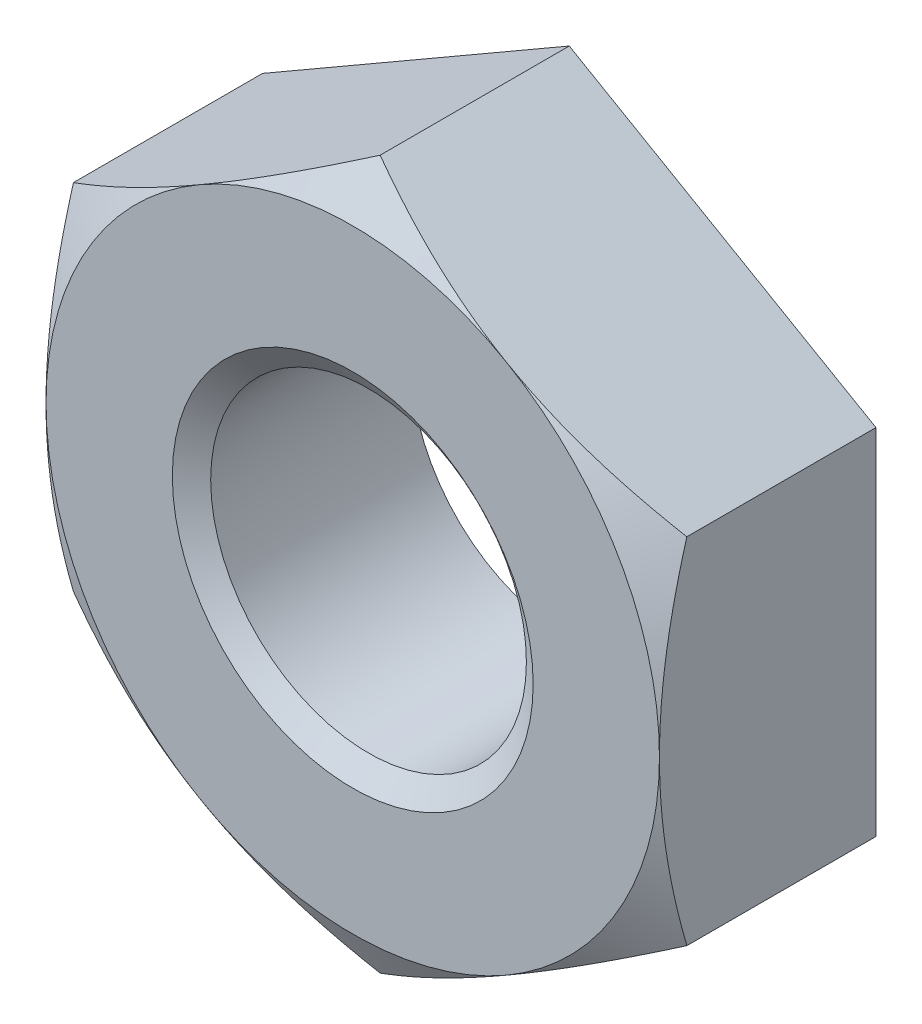
ISO-10303-21;
HEADER;
FILE_DESCRIPTION(('STEP AP214'),'2;1');
FILE_NAME('part.step','',(''),(''),'','','');
FILE_SCHEMA(('AUTOMOTIVE_DESIGN { 1 0 10303 214 1 1 1 1 }'));
ENDSEC;
DATA;
#1=APPLICATION_CONTEXT('core data for automotive mechanical design processes');
#2=APPLICATION_PROTOCOL_DEFINITION('international standard','automotive_design',2000,#1);
#3=PRODUCT_CONTEXT('',#1,'mechanical');
#4=PRODUCT('Part','Part','',(#3));
#5=PRODUCT_RELATED_PRODUCT_CATEGORY('part','',(#4));
#6=PRODUCT_DEFINITION_FORMATION('','',#4);
#7=PRODUCT_DEFINITION_CONTEXT('part definition',#1,'design');
#8=PRODUCT_DEFINITION('design','',#6,#7);
#9=PRODUCT_DEFINITION_SHAPE('','',#8);
#10=(LENGTH_UNIT() NAMED_UNIT(*) SI_UNIT(.MILLI.,.METRE.));
#11=(NAMED_UNIT(*) PLANE_ANGLE_UNIT() SI_UNIT($,.RADIAN.));
#12=(NAMED_UNIT(*) SI_UNIT($,.STERADIAN.) SOLID_ANGLE_UNIT());
#13=UNCERTAINTY_MEASURE_WITH_UNIT(LENGTH_MEASURE(1.E-05),#10,'distance_accuracy_value','');
#14=(GEOMETRIC_REPRESENTATION_CONTEXT(3) GLOBAL_UNCERTAINTY_ASSIGNED_CONTEXT((#13)) GLOBAL_UNIT_ASSIGNED_CONTEXT((#10,
#11,#12)) REPRESENTATION_CONTEXT('',''));
#15=CARTESIAN_POINT('',(0.,0.,0.));
#16=DIRECTION('',(0.,0.,1.));
#17=DIRECTION('',(1.,0.,0.));
#18=AXIS2_PLACEMENT_3D('',#15,#16,#17);
#19=CARTESIAN_POINT('',(0.,0.,-18.));
#20=DIRECTION('',(0.,0.,1.));
#21=DIRECTION('',(1.,0.,0.));
#22=AXIS2_PLACEMENT_3D('',#19,#20,#21);
#23=CYLINDRICAL_SURFACE('',#22,8.75);
#24=CARTESIAN_POINT('',(0.,0.,-0.87525942276214));
#25=DIRECTION('',(0.,0.,1.));
#26=DIRECTION('',(1.,0.,0.));
#27=AXIS2_PLACEMENT_3D('',#24,#25,#26);
#28=CIRCLE('',#27,8.75);
#29=CARTESIAN_POINT('',(8.75,0.,-0.87525942276214));
#30=VERTEX_POINT('',#29);
#31=EDGE_CURVE('E140',#30,#30,#28,.F.);
#32=ORIENTED_EDGE('',*,*,#31,.F.);
#33=EDGE_LOOP('',(#32));
#34=FACE_BOUND('',#33,.T.);
#35=CARTESIAN_POINT('',(0.,0.,-12.));
#36=DIRECTION('',(0.,0.,-1.));
#37=DIRECTION('',(-1.,0.,0.));
#38=AXIS2_PLACEMENT_3D('',#35,#36,#37);
#39=CIRCLE('',#38,8.75);
#40=CARTESIAN_POINT('',(-8.75,0.,-12.));
#41=VERTEX_POINT('',#40);
#42=EDGE_CURVE('E120',#41,#41,#39,.F.);
#43=ORIENTED_EDGE('',*,*,#42,.F.);
#44=EDGE_LOOP('',(#43));
#45=FACE_BOUND('',#44,.T.);
#46=ADVANCED_FACE('F37',(#34,#45),#23,.F.);
#47=CARTESIAN_POINT('',(0.,19.6299091524473,-18.));
#48=DIRECTION('',(-0.500000000000001,0.866025403784438,0.));
#49=DIRECTION('',(-0.866025403784438,-0.500000000000001,0.));
#50=AXIS2_PLACEMENT_3D('',#47,#48,#49);
#51=PLANE('',#50);
#52=DIRECTION('',(0.,0.,1.));
#53=VECTOR('',#52,1.);
#54=CARTESIAN_POINT('',(0.,19.6299091524473,-18.));
#55=LINE('',#54,#53);
#56=CARTESIAN_POINT('',(0.,19.6299091524473,-12.));
#57=VERTEX_POINT('',#56);
#58=CARTESIAN_POINT('',(0.,19.6299091524473,-1.51837875710971));
#59=VERTEX_POINT('',#58);
#60=EDGE_CURVE('E119',#57,#59,#55,.T.);
#61=ORIENTED_EDGE('',*,*,#60,.F.);
#62=DIRECTION('',(-0.866025403784438,-0.500000000000001,0.));
#63=VECTOR('',#62,1.);
#64=CARTESIAN_POINT('',(0.,19.6299091524473,-12.));
#65=LINE('',#64,#63);
#66=CARTESIAN_POINT('',(-17.,9.81495457622363,-12.));
#67=VERTEX_POINT('',#66);
#68=EDGE_CURVE('E108',#57,#67,#65,.T.);
#69=ORIENTED_EDGE('',*,*,#68,.T.);
#70=DIRECTION('',(0.,0.,1.));
#71=VECTOR('',#70,1.);
#72=CARTESIAN_POINT('',(-17.,9.81495457622363,-18.));
#73=LINE('',#72,#71);
#74=CARTESIAN_POINT('',(-17.,9.81495457622363,-1.51837875710971));
#75=VERTEX_POINT('',#74);
#76=EDGE_CURVE('E116',#67,#75,#73,.T.);
#77=ORIENTED_EDGE('',*,*,#76,.T.);
#78=CARTESIAN_POINT('',(-17.0002,9.81483910616979,-1.51844542436459));
#79=CARTESIAN_POINT('',(-16.6265469064567,10.0305678203105,-1.39390284028563));
#80=CARTESIAN_POINT('',(-16.251436365233,10.2471379922619,-1.27501178991296));
#81=CARTESIAN_POINT('',(-15.4982073403609,10.6820149725333,-1.05010368471724));
#82=CARTESIAN_POINT('',(-15.1200879107272,10.9003223270181,-0.944090864118266));
#83=CARTESIAN_POINT('',(-14.3601103187305,11.3390955943355,-0.746364244362128));
#84=CARTESIAN_POINT('',(-13.9782455058021,11.5595653468737,-0.654684278313972));
#85=CARTESIAN_POINT('',(-13.2118624748498,12.0020367960964,-0.487592038743615));
#86=CARTESIAN_POINT('',(-12.8273444100892,12.2240384042942,-0.412178833567624));
#87=CARTESIAN_POINT('',(-12.0655075393886,12.6638851266718,-0.280827660132113));
#88=CARTESIAN_POINT('',(-11.6882452921721,12.8816975866573,-0.224454943220501));
#89=CARTESIAN_POINT('',(-10.931992122991,13.3183205574595,-0.129930500105811));
#90=CARTESIAN_POINT('',(-10.5530011678939,13.5371310874053,-0.0917791246284545));
#91=CARTESIAN_POINT('',(-9.79438261780433,13.9751197115118,-0.0346606644570604));
#92=CARTESIAN_POINT('',(-9.41475631882946,14.1942970574164,-0.0156707830588131));
#93=CARTESIAN_POINT('',(-8.65515330704033,14.6328540607501,0.0027162994483032));
#94=CARTESIAN_POINT('',(-8.27517660541658,14.8522337117183,0.00211410596554385));
#95=CARTESIAN_POINT('',(-7.56480067427072,15.2623694467912,-0.0173147039239308));
#96=CARTESIAN_POINT('',(-7.23435083193734,15.4531547522161,-0.0337721505603473));
#97=CARTESIAN_POINT('',(-6.57423939634648,15.8342702672496,-0.081192533351074));
#98=CARTESIAN_POINT('',(-6.24457779186819,16.0246004833366,-0.112155261768023));
#99=CARTESIAN_POINT('',(-5.58616773221973,16.4047337085118,-0.188048945853774));
#100=CARTESIAN_POINT('',(-5.25742037514752,16.5945360836128,-0.232992533039556));
#101=CARTESIAN_POINT('',(-4.60149064349035,16.9732372907546,-0.336054853460988));
#102=CARTESIAN_POINT('',(-4.27430826227985,17.1621361266206,-0.394173530867515));
#103=CARTESIAN_POINT('',(-3.28110391077199,17.7355629263239,-0.589770338723494));
#104=CARTESIAN_POINT('',(-2.61795816688453,18.1184303000693,-0.746752038041314));
#105=CARTESIAN_POINT('',(-1.30155488695446,18.8784560880991,-1.1030361030205));
#106=CARTESIAN_POINT('',(-0.648280497058977,19.2556242329599,-1.30225479628516));
#107=CARTESIAN_POINT('',(0.000199999999998986,19.6300246225011,-1.51844542436461));
#108=B_SPLINE_CURVE_WITH_KNOTS('',3,(#78,#79,#80,#81,#82,#83,#84,#85,#86,#87,#88,#89,#90,#91,
#92,#93,#94,#95,#96,#97,#98,#99,#100,#101,#102,#103,#104,#105,#106,#107),.UNSPECIFIED.,.F.,.F.,
(4,2,2,2,2,2,2,2,2,2,2,2,2,2,4),(0.,1.34725361023887,2.69494899096531,4.04577911356303,
5.3965318488818,6.7139450767644,8.03138366129192,9.34725301563481,10.6630817087628,
11.808581597515,12.9540650814946,14.1005865149998,15.2471030902392,17.590639246696,
19.9295754772191),.UNSPECIFIED.);
#109=CARTESIAN_POINT('',(-8.50000000000002,14.7224318643354,0.));
#110=VERTEX_POINT('',#109);
#111=EDGE_CURVE('E134',#75,#110,#108,.T.);
#112=ORIENTED_EDGE('',*,*,#111,.T.);
#113=EDGE_CURVE('E128',#110,#59,#108,.T.);
#114=ORIENTED_EDGE('',*,*,#113,.T.);
#115=EDGE_LOOP('',(#61,#69,#77,#112,#114));
#116=FACE_BOUND('',#115,.T.);
#117=ADVANCED_FACE('F39',(#116),#51,.T.);
#118=CARTESIAN_POINT('',(17.,9.81495457622363,-18.));
#119=DIRECTION('',(0.500000000000001,0.866025403784438,0.));
#120=DIRECTION('',(-0.866025403784438,0.500000000000001,0.));
#121=AXIS2_PLACEMENT_3D('',#118,#119,#120);
#122=PLANE('',#121);
#123=DIRECTION('',(0.,0.,1.));
#124=VECTOR('',#123,1.);
#125=CARTESIAN_POINT('',(17.,9.81495457622363,-18.));
#126=LINE('',#125,#124);
#127=CARTESIAN_POINT('',(17.,9.81495457622363,-12.));
#128=VERTEX_POINT('',#127);
#129=CARTESIAN_POINT('',(17.,9.81495457622366,-1.51837875710971));
#130=VERTEX_POINT('',#129);
#131=EDGE_CURVE('E367',#128,#130,#126,.T.);
#132=ORIENTED_EDGE('',*,*,#131,.F.);
#133=DIRECTION('',(-0.866025403784438,0.500000000000001,0.));
#134=VECTOR('',#133,1.);
#135=CARTESIAN_POINT('',(17.,9.81495457622363,-12.));
#136=LINE('',#135,#134);
#137=EDGE_CURVE('E121',#128,#57,#136,.T.);
#138=ORIENTED_EDGE('',*,*,#137,.T.);
#139=ORIENTED_EDGE('',*,*,#60,.T.);
#140=CARTESIAN_POINT('',(-0.000200000000000661,19.6300246225011,-1.51844542436461));
#141=CARTESIAN_POINT('',(0.373453093543286,19.4142959083604,-1.39390284028564));
#142=CARTESIAN_POINT('',(0.748563634767009,19.197725736409,-1.27501178991297));
#143=CARTESIAN_POINT('',(1.50179265963908,18.7628487561377,-1.05010368471725));
#144=CARTESIAN_POINT('',(1.87991208927282,18.5445414016528,-0.944090864118278));
#145=CARTESIAN_POINT('',(2.63988968126951,18.1057681343354,-0.746364244362139));
#146=CARTESIAN_POINT('',(3.02175449419786,17.8852983817972,-0.654684278313981));
#147=CARTESIAN_POINT('',(3.78813752515019,17.4428269325745,-0.487592038743623));
#148=CARTESIAN_POINT('',(4.17265558991081,17.2208253243767,-0.412178833567631));
#149=CARTESIAN_POINT('',(4.9344924606114,16.7809786019991,-0.280827660132119));
#150=CARTESIAN_POINT('',(5.31175470782787,16.5631661420136,-0.224454943220505));
#151=CARTESIAN_POINT('',(6.06800787700896,16.1265431712114,-0.129930500105815));
#152=CARTESIAN_POINT('',(6.44699883210613,15.9077326412656,-0.0917791246284589));
#153=CARTESIAN_POINT('',(7.20561738219568,15.4697440171592,-0.0346606644570631));
#154=CARTESIAN_POINT('',(7.58524368117055,15.2505666712546,-0.015670783058814));
#155=CARTESIAN_POINT('',(8.34484669295968,14.8120096679209,0.00271629944830409));
#156=CARTESIAN_POINT('',(8.72482339458343,14.5926300169526,0.00211410596554441));
#157=CARTESIAN_POINT('',(9.43519932572929,14.1824942818797,-0.0173147039239293));
#158=CARTESIAN_POINT('',(9.76564916806266,13.9917089764549,-0.0337721505603448));
#159=CARTESIAN_POINT('',(10.4257606036535,13.6105934614213,-0.0811925333510706));
#160=CARTESIAN_POINT('',(10.7554222081318,13.4202632453343,-0.11215526176802));
#161=CARTESIAN_POINT('',(11.4138322677803,13.0401300201591,-0.188048945853771));
#162=CARTESIAN_POINT('',(11.7425796248525,12.8503276450581,-0.232992533039552));
#163=CARTESIAN_POINT('',(12.3985093565097,12.4716264379163,-0.336054853460981));
#164=CARTESIAN_POINT('',(12.7256917377202,12.2827276020503,-0.394173530867508));
#165=CARTESIAN_POINT('',(13.718896089228,11.709300802347,-0.589770338723484));
#166=CARTESIAN_POINT('',(14.3820418331155,11.3264334286016,-0.746752038041304));
#167=CARTESIAN_POINT('',(15.6984451130455,10.5664076405719,-1.10303610302049));
#168=CARTESIAN_POINT('',(16.351719502941,10.189239495711,-1.30225479628515));
#169=CARTESIAN_POINT('',(17.0002,9.81483910616979,-1.5184454243646));
#170=B_SPLINE_CURVE_WITH_KNOTS('',3,(#140,#141,#142,#143,#144,#145,#146,#147,#148,#149,#150,
#151,#152,#153,#154,#155,#156,#157,#158,#159,#160,#161,#162,#163,#164,#165,#166,#167,#168,#169),
.UNSPECIFIED.,.F.,.F.,(4,2,2,2,2,2,2,2,2,2,2,2,2,2,4),(0.,1.34725361023887,2.69494899096531,
4.04577911356304,5.39653184888181,6.71394507676441,8.03138366129193,9.34725301563482,
10.6630817087629,11.808581597515,12.9540650814946,14.1005865149998,15.2471030902392,
17.590639246696,19.9295754772191),.UNSPECIFIED.);
#171=CARTESIAN_POINT('',(8.50000000000002,14.7224318643354,0.));
#172=VERTEX_POINT('',#171);
#173=EDGE_CURVE('E132',#59,#172,#170,.T.);
#174=ORIENTED_EDGE('',*,*,#173,.T.);
#175=EDGE_CURVE('E199',#172,#130,#170,.T.);
#176=ORIENTED_EDGE('',*,*,#175,.T.);
#177=EDGE_LOOP('',(#132,#138,#139,#174,#176));
#178=FACE_BOUND('',#177,.T.);
#179=ADVANCED_FACE('F207',(#178),#122,.T.);
#180=CARTESIAN_POINT('',(17.,9.81495457622363,-18.));
#181=DIRECTION('',(-1.,0.,0.));
#182=DIRECTION('',(0.,0.,1.));
#183=AXIS2_PLACEMENT_3D('',#180,#181,#182);
#184=PLANE('',#183);
#185=DIRECTION('',(0.,-1.,0.));
#186=VECTOR('',#185,1.);
#187=CARTESIAN_POINT('',(17.,9.81495457622363,-12.));
#188=LINE('',#187,#186);
#189=CARTESIAN_POINT('',(17.,-9.81495457622366,-12.));
#190=VERTEX_POINT('',#189);
#191=EDGE_CURVE('E375',#128,#190,#188,.T.);
#192=ORIENTED_EDGE('',*,*,#191,.F.);
#193=ORIENTED_EDGE('',*,*,#131,.T.);
#194=CARTESIAN_POINT('',(17.,-26.0307059573251,-8.13495399027259));
#195=CARTESIAN_POINT('',(17.,-25.6575217464222,-7.95456227682772));
#196=CARTESIAN_POINT('',(17.,-25.2838864668895,-7.7751041700818));
#197=CARTESIAN_POINT('',(17.,-24.5356184753721,-7.41826946686462));
#198=CARTESIAN_POINT('',(17.,-24.1609857524832,-7.24089289326483));
#199=CARTESIAN_POINT('',(17.,-23.0353387824394,-6.71215553542932));
#200=CARTESIAN_POINT('',(17.,-22.2826970223696,-6.36424591266771));
#201=CARTESIAN_POINT('',(17.,-20.7679056340487,-5.6778850810937));
#202=CARTESIAN_POINT('',(17.,-20.0057262436994,-5.33949939236385));
#203=CARTESIAN_POINT('',(17.,-18.4751037993147,-4.67725670204686));
#204=CARTESIAN_POINT('',(17.,-17.7066610739857,-4.35339894374694));
#205=CARTESIAN_POINT('',(17.,-16.152750515159,-3.72023983263543));
#206=CARTESIAN_POINT('',(17.,-15.3671894876041,-3.41116600065135));
#207=CARTESIAN_POINT('',(17.,-13.7867962702783,-2.81722387280742));
#208=CARTESIAN_POINT('',(17.,-12.9919630611931,-2.53235826728805));
#209=CARTESIAN_POINT('',(17.,-11.3934196408484,-1.99449069513075));
#210=CARTESIAN_POINT('',(17.,-10.589732412385,-1.74142098317551));
#211=CARTESIAN_POINT('',(17.,-8.97085479846399,-1.27535153171701));
#212=CARTESIAN_POINT('',(17.,-8.15566813481674,-1.06233913357713));
#213=CARTESIAN_POINT('',(17.,-6.92410865272041,-0.780661296528767));
#214=CARTESIAN_POINT('',(17.,-6.51203814311503,-0.693061061895628));
#215=CARTESIAN_POINT('',(17.,-5.68515456409968,-0.53185744366809));
#216=CARTESIAN_POINT('',(17.,-5.27034155649819,-0.458253745734814));
#217=CARTESIAN_POINT('',(17.,-4.43825138158013,-0.326348089552295));
#218=CARTESIAN_POINT('',(17.,-4.02097406453077,-0.26804707108962));
#219=CARTESIAN_POINT('',(17.,-3.1844334141547,-0.167917766349056));
#220=CARTESIAN_POINT('',(17.,-2.76517007846817,-0.126089499649218));
#221=CARTESIAN_POINT('',(17.,-1.9279303711508,-0.0600317653446426));
#222=CARTESIAN_POINT('',(17.,-1.509962744708,-0.0356921826966871));
#223=CARTESIAN_POINT('',(17.,-0.673373708487022,-0.00473977414655556));
#224=CARTESIAN_POINT('',(17.,-0.254752308682776,0.00187331959710131));
#225=CARTESIAN_POINT('',(17.,0.582277132138507,-0.00278408961653836));
#226=CARTESIAN_POINT('',(17.,1.00068520014185,-0.0140496454640468));
#227=CARTESIAN_POINT('',(17.,1.83665802666531,-0.0541842328224468));
#228=CARTESIAN_POINT('',(17.,2.25422274725055,-0.0830540392488162));
#229=CARTESIAN_POINT('',(17.,3.26596548953816,-0.173730271570588));
#230=CARTESIAN_POINT('',(17.,3.85936997082711,-0.244339277604261));
#231=CARTESIAN_POINT('',(17.,5.04153028914376,-0.417178538994495));
#232=CARTESIAN_POINT('',(17.,5.6302854232218,-0.519413485537222));
#233=CARTESIAN_POINT('',(17.,7.39060393555853,-0.868429445666578));
#234=CARTESIAN_POINT('',(17.,8.55392089461046,-1.15728923610046));
#235=CARTESIAN_POINT('',(17.,10.2940487146074,-1.65537919816158));
#236=CARTESIAN_POINT('',(17.,10.8799513250967,-1.83464660500476));
#237=CARTESIAN_POINT('',(17.,12.0460961408978,-2.2110551280317));
#238=CARTESIAN_POINT('',(17.,12.6263378299922,-2.40819785769475));
#239=CARTESIAN_POINT('',(17.,13.7782685216328,-2.81615640996964));
#240=CARTESIAN_POINT('',(17.,14.3499873028968,-3.026888854635));
#241=CARTESIAN_POINT('',(17.,15.2039647570376,-3.35211134833674));
#242=CARTESIAN_POINT('',(17.,15.4879778979513,-3.46202087029117));
#243=CARTESIAN_POINT('',(17.,16.0549008675384,-3.68463436238699));
#244=CARTESIAN_POINT('',(17.,16.3378107179562,-3.79733827712912));
#245=CARTESIAN_POINT('',(17.,16.6202072069337,-3.91131327780249));
#246=B_SPLINE_CURVE_WITH_KNOTS('',3,(#194,#195,#196,#197,#198,#199,#200,#201,#202,#203,#204,
#205,#206,#207,#208,#209,#210,#211,#212,#213,#214,#215,#216,#217,#218,#219,#220,#221,#222,#223,
#224,#225,#226,#227,#228,#229,#230,#231,#232,#233,#234,#235,#236,#237,#238,#239,#240,#241,#242,
#243,#244,#245),.UNSPECIFIED.,.F.,.F.,(4,2,2,2,2,2,2,2,2,2,2,2,2,2,2,2,2,2,2,2,2,2,2,2,2,4),(0.,
1.24348808133114,2.48698981309042,4.97439762001852,7.47603986059144,9.97755164707598,
12.5097743231098,15.0422780464305,17.5692909808311,20.0955039990755,21.359141208012,
22.6227500344112,23.8864364449289,25.1501243573476,26.4057842021083,27.6614250741502,
28.9167185647953,30.172067315764,31.9638212136511,33.7558410161945,37.3467834852116,
39.184781807894,41.0229461991888,42.8507444220586,43.7643464599212,44.6779303999485),.UNSPECIFIED.);
#247=CARTESIAN_POINT('',(17.,0.,0.));
#248=VERTEX_POINT('',#247);
#249=EDGE_CURVE('E198',#248,#130,#246,.T.);
#250=ORIENTED_EDGE('',*,*,#249,.F.);
#251=CARTESIAN_POINT('',(17.,-9.81495457622367,-1.51837875710971));
#252=VERTEX_POINT('',#251);
#253=EDGE_CURVE('E190',#252,#248,#246,.T.);
#254=ORIENTED_EDGE('',*,*,#253,.F.);
#255=DIRECTION('',(0.,0.,1.));
#256=VECTOR('',#255,1.);
#257=CARTESIAN_POINT('',(17.,-9.81495457622366,-18.));
#258=LINE('',#257,#256);
#259=EDGE_CURVE('E374',#190,#252,#258,.T.);
#260=ORIENTED_EDGE('',*,*,#259,.F.);
#261=EDGE_LOOP('',(#192,#193,#250,#254,#260));
#262=FACE_BOUND('',#261,.T.);
#263=ADVANCED_FACE('F210',(#262),#184,.F.);
#264=CARTESIAN_POINT('',(0.,-19.6299091524473,-18.));
#265=DIRECTION('',(0.500000000000001,-0.866025403784438,0.));
#266=DIRECTION('',(0.866025403784438,0.500000000000001,0.));
#267=AXIS2_PLACEMENT_3D('',#264,#265,#266);
#268=PLANE('',#267);
#269=DIRECTION('',(0.,0.,1.));
#270=VECTOR('',#269,1.);
#271=CARTESIAN_POINT('',(0.,-19.6299091524473,-18.));
#272=LINE('',#271,#270);
#273=CARTESIAN_POINT('',(0.,-19.6299091524473,-12.));
#274=VERTEX_POINT('',#273);
#275=CARTESIAN_POINT('',(0.,-19.6299091524473,-1.51837875710971));
#276=VERTEX_POINT('',#275);
#277=EDGE_CURVE('E130',#274,#276,#272,.T.);
#278=ORIENTED_EDGE('',*,*,#277,.F.);
#279=DIRECTION('',(0.866025403784438,0.500000000000001,0.));
#280=VECTOR('',#279,1.);
#281=CARTESIAN_POINT('',(0.,-19.6299091524473,-12.));
#282=LINE('',#281,#280);
#283=EDGE_CURVE('E378',#274,#190,#282,.T.);
#284=ORIENTED_EDGE('',*,*,#283,.T.);
#285=ORIENTED_EDGE('',*,*,#259,.T.);
#286=CARTESIAN_POINT('',(17.0002,-9.81483910616983,-1.51844542436461));
#287=CARTESIAN_POINT('',(16.6265469064567,-10.0305678203106,-1.39390284028564));
#288=CARTESIAN_POINT('',(16.251436365233,-10.247137992262,-1.27501178991297));
#289=CARTESIAN_POINT('',(15.4982073403609,-10.6820149725333,-1.05010368471725));
#290=CARTESIAN_POINT('',(15.1200879107272,-10.9003223270182,-0.944090864118282));
#291=CARTESIAN_POINT('',(14.3601103187305,-11.3390955943355,-0.746364244362145));
#292=CARTESIAN_POINT('',(13.9782455058021,-11.5595653468738,-0.654684278313987));
#293=CARTESIAN_POINT('',(13.2118624748498,-12.0020367960965,-0.48759203874363));
#294=CARTESIAN_POINT('',(12.8273444100892,-12.2240384042943,-0.412178833567639));
#295=CARTESIAN_POINT('',(12.0655075393886,-12.6638851266718,-0.28082766013213));
#296=CARTESIAN_POINT('',(11.6882452921721,-12.8816975866574,-0.224454943220519));
#297=CARTESIAN_POINT('',(10.931992122991,-13.3183205574596,-0.129930500105831));
#298=CARTESIAN_POINT('',(10.5530011678939,-13.5371310874054,-0.0917791246284741));
#299=CARTESIAN_POINT('',(9.79438261780432,-13.9751197115118,-0.0346606644570798));
#300=CARTESIAN_POINT('',(9.41475631882945,-14.1942970574164,-0.0156707830588324));
#301=CARTESIAN_POINT('',(8.65515330704033,-14.6328540607501,0.00271629944828347));
#302=CARTESIAN_POINT('',(8.27517660541657,-14.8522337117184,0.00211410596552351));
#303=CARTESIAN_POINT('',(7.56480067427071,-15.2623694467913,-0.0173147039239514));
#304=CARTESIAN_POINT('',(7.23435083193734,-15.4531547522161,-0.0337721505603677));
#305=CARTESIAN_POINT('',(6.57423939634647,-15.8342702672496,-0.0811925333510953));
#306=CARTESIAN_POINT('',(6.24457779186819,-16.0246004833367,-0.112155261768046));
#307=CARTESIAN_POINT('',(5.58616773221972,-16.4047337085119,-0.188048945853798));
#308=CARTESIAN_POINT('',(5.25742037514751,-16.5945360836129,-0.23299253303958));
#309=CARTESIAN_POINT('',(4.60149064349034,-16.9732372907546,-0.33605485346101));
#310=CARTESIAN_POINT('',(4.27430826227984,-17.1621361266206,-0.394173530867538));
#311=CARTESIAN_POINT('',(3.28110391077199,-17.735562926324,-0.589770338723516));
#312=CARTESIAN_POINT('',(2.61795816688453,-18.1184303000694,-0.746752038041335));
#313=CARTESIAN_POINT('',(1.30155488695446,-18.8784560880991,-1.10303610302052));
#314=CARTESIAN_POINT('',(0.648280497058978,-19.2556242329599,-1.30225479628518));
#315=CARTESIAN_POINT('',(-0.000199999999998373,-19.6300246225012,-1.51844542436463));
#316=B_SPLINE_CURVE_WITH_KNOTS('',3,(#286,#287,#288,#289,#290,#291,#292,#293,#294,#295,#296,
#297,#298,#299,#300,#301,#302,#303,#304,#305,#306,#307,#308,#309,#310,#311,#312,#313,#314,#315),
.UNSPECIFIED.,.F.,.F.,(4,2,2,2,2,2,2,2,2,2,2,2,2,2,4),(0.,1.34725361023886,2.69494899096531,
4.04577911356304,5.39653184888181,6.71394507676441,8.03138366129193,9.34725301563482,
10.6630817087629,11.808581597515,12.9540650814946,14.1005865149998,15.2471030902392,
17.590639246696,19.9295754772191),.UNSPECIFIED.);
#317=CARTESIAN_POINT('',(8.50000000000002,-14.7224318643354,0.));
#318=VERTEX_POINT('',#317);
#319=EDGE_CURVE('E355',#252,#318,#316,.T.);
#320=ORIENTED_EDGE('',*,*,#319,.T.);
#321=EDGE_CURVE('E184',#318,#276,#316,.T.);
#322=ORIENTED_EDGE('',*,*,#321,.T.);
#323=EDGE_LOOP('',(#278,#284,#285,#320,#322));
#324=FACE_BOUND('',#323,.T.);
#325=ADVANCED_FACE('F215',(#324),#268,.T.);
#326=CARTESIAN_POINT('',(-17.,-9.81495457622367,-18.));
#327=DIRECTION('',(-0.500000000000001,-0.866025403784438,0.));
#328=DIRECTION('',(0.866025403784438,-0.500000000000001,0.));
#329=AXIS2_PLACEMENT_3D('',#326,#327,#328);
#330=PLANE('',#329);
#331=DIRECTION('',(0.,0.,1.));
#332=VECTOR('',#331,1.);
#333=CARTESIAN_POINT('',(-17.,-9.81495457622367,-18.));
#334=LINE('',#333,#332);
#335=CARTESIAN_POINT('',(-17.,-9.81495457622367,-12.));
#336=VERTEX_POINT('',#335);
#337=CARTESIAN_POINT('',(-17.,-9.81495457622367,-1.51837875710971));
#338=VERTEX_POINT('',#337);
#339=EDGE_CURVE('E127',#336,#338,#334,.T.);
#340=ORIENTED_EDGE('',*,*,#339,.F.);
#341=DIRECTION('',(0.866025403784438,-0.500000000000001,0.));
#342=VECTOR('',#341,1.);
#343=CARTESIAN_POINT('',(-17.,-9.81495457622367,-12.));
#344=LINE('',#343,#342);
#345=EDGE_CURVE('E53',#336,#274,#344,.T.);
#346=ORIENTED_EDGE('',*,*,#345,.T.);
#347=ORIENTED_EDGE('',*,*,#277,.T.);
#348=CARTESIAN_POINT('',(0.000200000000002235,-19.6300246225012,-1.51844542436463));
#349=CARTESIAN_POINT('',(-0.373453093543285,-19.4142959083604,-1.39390284028567));
#350=CARTESIAN_POINT('',(-0.74856363476701,-19.197725736409,-1.27501178991299));
#351=CARTESIAN_POINT('',(-1.50179265963908,-18.7628487561377,-1.05010368471727));
#352=CARTESIAN_POINT('',(-1.87991208927283,-18.5445414016528,-0.944090864118298));
#353=CARTESIAN_POINT('',(-2.63988968126951,-18.1057681343355,-0.746364244362159));
#354=CARTESIAN_POINT('',(-3.02175449419786,-17.8852983817972,-0.654684278314001));
#355=CARTESIAN_POINT('',(-3.78813752515019,-17.4428269325745,-0.487592038743642));
#356=CARTESIAN_POINT('',(-4.17265558991081,-17.2208253243767,-0.41217883356765));
#357=CARTESIAN_POINT('',(-4.93449246061141,-16.7809786019992,-0.280827660132138));
#358=CARTESIAN_POINT('',(-5.31175470782788,-16.5631661420136,-0.224454943220525));
#359=CARTESIAN_POINT('',(-6.06800787700897,-16.1265431712114,-0.129930500105836));
#360=CARTESIAN_POINT('',(-6.44699883210614,-15.9077326412656,-0.0917791246284797));
#361=CARTESIAN_POINT('',(-7.20561738219569,-15.4697440171592,-0.0346606644570832));
#362=CARTESIAN_POINT('',(-7.58524368117056,-15.2505666712546,-0.015670783058833));
#363=CARTESIAN_POINT('',(-8.34484669295969,-14.8120096679209,0.00271629944828505));
#364=CARTESIAN_POINT('',(-8.72482339458345,-14.5926300169526,0.00211410596552435));
#365=CARTESIAN_POINT('',(-9.43519932572931,-14.1824942818797,-0.0173147039239493));
#366=CARTESIAN_POINT('',(-9.76564916806268,-13.9917089764549,-0.0337721505603639));
#367=CARTESIAN_POINT('',(-10.4257606036535,-13.6105934614213,-0.0811925333510895));
#368=CARTESIAN_POINT('',(-10.7554222081318,-13.4202632453343,-0.11215526176804));
#369=CARTESIAN_POINT('',(-11.4138322677803,-13.0401300201591,-0.188048945853789));
#370=CARTESIAN_POINT('',(-11.7425796248525,-12.8503276450581,-0.232992533039569));
#371=CARTESIAN_POINT('',(-12.3985093565097,-12.4716264379164,-0.336054853460998));
#372=CARTESIAN_POINT('',(-12.7256917377202,-12.2827276020504,-0.394173530867526));
#373=CARTESIAN_POINT('',(-13.718896089228,-11.709300802347,-0.589770338723503));
#374=CARTESIAN_POINT('',(-14.3820418331155,-11.3264334286016,-0.74675203804132));
#375=CARTESIAN_POINT('',(-15.6984451130455,-10.5664076405719,-1.1030361030205));
#376=CARTESIAN_POINT('',(-16.351719502941,-10.189239495711,-1.30225479628516));
#377=CARTESIAN_POINT('',(-17.0002,-9.81483910616983,-1.51844542436461));
#378=B_SPLINE_CURVE_WITH_KNOTS('',3,(#348,#349,#350,#351,#352,#353,#354,#355,#356,#357,#358,
#359,#360,#361,#362,#363,#364,#365,#366,#367,#368,#369,#370,#371,#372,#373,#374,#375,#376,#377),
.UNSPECIFIED.,.F.,.F.,(4,2,2,2,2,2,2,2,2,2,2,2,2,2,4),(0.,1.34725361023887,2.69494899096531,
4.04577911356304,5.39653184888182,6.71394507676442,8.03138366129195,9.34725301563484,
10.6630817087629,11.8085815975151,12.9540650814947,14.1005865149998,15.2471030902393,
17.590639246696,19.9295754772191),.UNSPECIFIED.);
#379=CARTESIAN_POINT('',(-8.50000000000002,-14.7224318643354,0.));
#380=VERTEX_POINT('',#379);
#381=EDGE_CURVE('E352',#276,#380,#378,.T.);
#382=ORIENTED_EDGE('',*,*,#381,.T.);
#383=EDGE_CURVE('E161',#380,#338,#378,.T.);
#384=ORIENTED_EDGE('',*,*,#383,.T.);
#385=EDGE_LOOP('',(#340,#346,#347,#382,#384));
#386=FACE_BOUND('',#385,.T.);
#387=ADVANCED_FACE('F219',(#386),#330,.T.);
#388=CARTESIAN_POINT('',(-17.,9.81495457622363,-18.));
#389=DIRECTION('',(-1.,0.,0.));
#390=DIRECTION('',(0.,0.,1.));
#391=AXIS2_PLACEMENT_3D('',#388,#389,#390);
#392=PLANE('',#391);
#393=ORIENTED_EDGE('',*,*,#76,.F.);
#394=DIRECTION('',(0.,-1.,0.));
#395=VECTOR('',#394,1.);
#396=CARTESIAN_POINT('',(-17.,9.81495457622363,-12.));
#397=LINE('',#396,#395);
#398=EDGE_CURVE('E12',#67,#336,#397,.T.);
#399=ORIENTED_EDGE('',*,*,#398,.T.);
#400=ORIENTED_EDGE('',*,*,#339,.T.);
#401=CARTESIAN_POINT('',(-17.,-26.0307059573251,-8.13495399027259));
#402=CARTESIAN_POINT('',(-17.,-25.6575217464222,-7.95456227682772));
#403=CARTESIAN_POINT('',(-17.,-25.2838864668895,-7.7751041700818));
#404=CARTESIAN_POINT('',(-17.,-24.5356184753721,-7.41826946686462));
#405=CARTESIAN_POINT('',(-17.,-24.1609857524832,-7.24089289326483));
#406=CARTESIAN_POINT('',(-17.,-23.0353387824394,-6.71215553542932));
#407=CARTESIAN_POINT('',(-17.,-22.2826970223696,-6.36424591266771));
#408=CARTESIAN_POINT('',(-17.,-20.7679056340488,-5.6778850810937));
#409=CARTESIAN_POINT('',(-17.,-20.0057262436994,-5.33949939236386));
#410=CARTESIAN_POINT('',(-17.,-18.4751037993147,-4.67725670204686));
#411=CARTESIAN_POINT('',(-17.,-17.7066610739857,-4.35339894374694));
#412=CARTESIAN_POINT('',(-17.,-16.152750515159,-3.72023983263543));
#413=CARTESIAN_POINT('',(-17.,-15.3671894876041,-3.41116600065135));
#414=CARTESIAN_POINT('',(-17.,-13.7867962702783,-2.81722387280742));
#415=CARTESIAN_POINT('',(-17.,-12.9919630611931,-2.53235826728805));
#416=CARTESIAN_POINT('',(-17.,-11.3934196408484,-1.99449069513075));
#417=CARTESIAN_POINT('',(-17.,-10.589732412385,-1.74142098317551));
#418=CARTESIAN_POINT('',(-17.,-8.97085479846399,-1.27535153171701));
#419=CARTESIAN_POINT('',(-17.,-8.15566813481674,-1.06233913357713));
#420=CARTESIAN_POINT('',(-17.,-6.92410865272041,-0.780661296528766));
#421=CARTESIAN_POINT('',(-17.,-6.51203814311503,-0.693061061895626));
#422=CARTESIAN_POINT('',(-17.,-5.68515456409968,-0.531857443668088));
#423=CARTESIAN_POINT('',(-17.,-5.27034155649819,-0.458253745734814));
#424=CARTESIAN_POINT('',(-17.,-4.43825138158013,-0.326348089552295));
#425=CARTESIAN_POINT('',(-17.,-4.02097406453078,-0.268047071089618));
#426=CARTESIAN_POINT('',(-17.,-3.1844334141547,-0.167917766349054));
#427=CARTESIAN_POINT('',(-17.,-2.76517007846817,-0.126089499649216));
#428=CARTESIAN_POINT('',(-17.,-1.9279303711508,-0.0600317653446408));
#429=CARTESIAN_POINT('',(-17.,-1.509962744708,-0.0356921826966852));
#430=CARTESIAN_POINT('',(-17.,-0.673373708487023,-0.00473977414655345));
#431=CARTESIAN_POINT('',(-17.,-0.254752308682776,0.00187331959710339));
#432=CARTESIAN_POINT('',(-17.,0.582277132138507,-0.00278408961653642));
#433=CARTESIAN_POINT('',(-17.,1.00068520014185,-0.0140496454640449));
#434=CARTESIAN_POINT('',(-17.,1.83665802666531,-0.0541842328224447));
#435=CARTESIAN_POINT('',(-17.,2.25422274725055,-0.083054039248814));
#436=CARTESIAN_POINT('',(-17.,3.26596548953816,-0.173730271570586));
#437=CARTESIAN_POINT('',(-17.,3.8593699708271,-0.244339277604259));
#438=CARTESIAN_POINT('',(-17.,5.04153028914375,-0.417178538994493));
#439=CARTESIAN_POINT('',(-17.,5.6302854232218,-0.51941348553722));
#440=CARTESIAN_POINT('',(-17.,7.39060393555853,-0.868429445666575));
#441=CARTESIAN_POINT('',(-17.,8.55392089461047,-1.15728923610046));
#442=CARTESIAN_POINT('',(-17.,10.2940487146074,-1.65537919816158));
#443=CARTESIAN_POINT('',(-17.,10.8799513250967,-1.83464660500476));
#444=CARTESIAN_POINT('',(-17.,12.0460961408978,-2.2110551280317));
#445=CARTESIAN_POINT('',(-17.,12.6263378299922,-2.40819785769475));
#446=CARTESIAN_POINT('',(-17.,13.7782685216328,-2.81615640996963));
#447=CARTESIAN_POINT('',(-17.,14.3499873028968,-3.026888854635));
#448=CARTESIAN_POINT('',(-17.,15.2039647570376,-3.35211134833674));
#449=CARTESIAN_POINT('',(-17.,15.4879778979513,-3.46202087029117));
#450=CARTESIAN_POINT('',(-17.,16.0549008675384,-3.68463436238698));
#451=CARTESIAN_POINT('',(-17.,16.3378107179562,-3.79733827712912));
#452=CARTESIAN_POINT('',(-17.,16.6202072069337,-3.91131327780249));
#453=B_SPLINE_CURVE_WITH_KNOTS('',3,(#401,#402,#403,#404,#405,#406,#407,#408,#409,#410,#411,
#412,#413,#414,#415,#416,#417,#418,#419,#420,#421,#422,#423,#424,#425,#426,#427,#428,#429,#430,
#431,#432,#433,#434,#435,#436,#437,#438,#439,#440,#441,#442,#443,#444,#445,#446,#447,#448,#449,
#450,#451,#452),.UNSPECIFIED.,.F.,.F.,(4,2,2,2,2,2,2,2,2,2,2,2,2,2,2,2,2,2,2,2,2,2,2,2,2,4),(0.,
1.24348808133114,2.48698981309042,4.97439762001852,7.47603986059144,9.97755164707598,
12.5097743231098,15.0422780464305,17.5692909808311,20.0955039990755,21.359141208012,
22.6227500344112,23.8864364449289,25.1501243573476,26.4057842021083,27.6614250741502,
28.9167185647953,30.172067315764,31.9638212136511,33.7558410161945,37.3467834852116,
39.184781807894,41.0229461991888,42.8507444220586,43.7643464599212,44.6779303999485),.UNSPECIFIED.);
#454=CARTESIAN_POINT('',(-17.,0.,0.));
#455=VERTEX_POINT('',#454);
#456=EDGE_CURVE('E160',#338,#455,#453,.T.);
#457=ORIENTED_EDGE('',*,*,#456,.T.);
#458=EDGE_CURVE('E126',#455,#75,#453,.T.);
#459=ORIENTED_EDGE('',*,*,#458,.T.);
#460=EDGE_LOOP('',(#393,#399,#400,#457,#459));
#461=FACE_BOUND('',#460,.T.);
#462=ADVANCED_FACE('F124',(#461),#392,.T.);
#463=CARTESIAN_POINT('',(0.,19.6299091524473,0.));
#464=DIRECTION('',(0.,0.,-1.));
#465=DIRECTION('',(-1.,0.,0.));
#466=AXIS2_PLACEMENT_3D('',#463,#464,#465);
#467=PLANE('',#466);
#468=CARTESIAN_POINT('',(0.,0.,0.));
#469=DIRECTION('',(0.,0.,1.));
#470=DIRECTION('',(1.,0.,0.));
#471=AXIS2_PLACEMENT_3D('',#468,#469,#470);
#472=CIRCLE('',#471,10.);
#473=CARTESIAN_POINT('',(10.,0.,0.));
#474=VERTEX_POINT('',#473);
#475=EDGE_CURVE('E143',#474,#474,#472,.T.);
#476=ORIENTED_EDGE('',*,*,#475,.F.);
#477=EDGE_LOOP('',(#476));
#478=FACE_BOUND('',#477,.T.);
#479=CARTESIAN_POINT('',(0.,0.,0.));
#480=DIRECTION('',(0.,0.,-1.));
#481=DIRECTION('',(-1.,0.,0.));
#482=AXIS2_PLACEMENT_3D('',#479,#480,#481);
#483=CIRCLE('',#482,17.);
#484=EDGE_CURVE('E137',#110,#455,#483,.F.);
#485=ORIENTED_EDGE('',*,*,#484,.T.);
#486=EDGE_CURVE('E46',#455,#380,#483,.F.);
#487=ORIENTED_EDGE('',*,*,#486,.T.);
#488=EDGE_CURVE('E371',#380,#318,#483,.F.);
#489=ORIENTED_EDGE('',*,*,#488,.T.);
#490=EDGE_CURVE('E369',#318,#248,#483,.F.);
#491=ORIENTED_EDGE('',*,*,#490,.T.);
#492=CARTESIAN_POINT('',(0.,0.,0.));
#493=DIRECTION('',(0.,0.,1.));
#494=DIRECTION('',(1.,0.,0.));
#495=AXIS2_PLACEMENT_3D('',#492,#493,#494);
#496=CIRCLE('',#495,17.);
#497=EDGE_CURVE('E142',#248,#172,#496,.T.);
#498=ORIENTED_EDGE('',*,*,#497,.T.);
#499=EDGE_CURVE('E139',#172,#110,#483,.F.);
#500=ORIENTED_EDGE('',*,*,#499,.T.);
#501=EDGE_LOOP('',(#485,#487,#489,#491,#498,#500));
#502=FACE_BOUND('',#501,.T.);
#503=ADVANCED_FACE('F212',(#478,#502),#467,.F.);
#504=CARTESIAN_POINT('',(0.,0.,0.));
#505=DIRECTION('',(0.,0.,-1.));
#506=DIRECTION('',(-1.,0.,0.));
#507=AXIS2_PLACEMENT_3D('',#504,#505,#506);
#508=CONICAL_SURFACE('',#507,17.,1.0471975511966);
#509=ORIENTED_EDGE('',*,*,#458,.F.);
#510=ORIENTED_EDGE('',*,*,#484,.F.);
#511=ORIENTED_EDGE('',*,*,#111,.F.);
#512=EDGE_LOOP('',(#509,#510,#511));
#513=FACE_BOUND('',#512,.T.);
#514=ADVANCED_FACE('F303',(#513),#508,.T.);
#515=ORIENTED_EDGE('',*,*,#499,.F.);
#516=ORIENTED_EDGE('',*,*,#173,.F.);
#517=ORIENTED_EDGE('',*,*,#113,.F.);
#518=EDGE_LOOP('',(#515,#516,#517));
#519=FACE_BOUND('',#518,.T.);
#520=ADVANCED_FACE('F175',(#519),#508,.T.);
#521=ORIENTED_EDGE('',*,*,#497,.F.);
#522=ORIENTED_EDGE('',*,*,#249,.T.);
#523=ORIENTED_EDGE('',*,*,#175,.F.);
#524=EDGE_LOOP('',(#521,#522,#523));
#525=FACE_BOUND('',#524,.T.);
#526=ADVANCED_FACE('F310',(#525),#508,.T.);
#527=ORIENTED_EDGE('',*,*,#253,.T.);
#528=ORIENTED_EDGE('',*,*,#490,.F.);
#529=ORIENTED_EDGE('',*,*,#319,.F.);
#530=EDGE_LOOP('',(#527,#528,#529));
#531=FACE_BOUND('',#530,.T.);
#532=ADVANCED_FACE('F301',(#531),#508,.T.);
#533=ORIENTED_EDGE('',*,*,#488,.F.);
#534=ORIENTED_EDGE('',*,*,#381,.F.);
#535=ORIENTED_EDGE('',*,*,#321,.F.);
#536=EDGE_LOOP('',(#533,#534,#535));
#537=FACE_BOUND('',#536,.T.);
#538=ADVANCED_FACE('F174',(#537),#508,.T.);
#539=ORIENTED_EDGE('',*,*,#486,.F.);
#540=ORIENTED_EDGE('',*,*,#456,.F.);
#541=ORIENTED_EDGE('',*,*,#383,.F.);
#542=EDGE_LOOP('',(#539,#540,#541));
#543=FACE_BOUND('',#542,.T.);
#544=ADVANCED_FACE('F168',(#543),#508,.T.);
#545=CARTESIAN_POINT('',(0.,0.,-0.962785365038354));
#546=DIRECTION('',(0.,0.,1.));
#547=DIRECTION('',(1.,0.,0.));
#548=AXIS2_PLACEMENT_3D('',#545,#546,#547);
#549=CONICAL_SURFACE('',#548,8.625,0.959931088596878);
#550=ORIENTED_EDGE('',*,*,#475,.T.);
#551=EDGE_LOOP('',(#550));
#552=FACE_BOUND('',#551,.T.);
#553=ORIENTED_EDGE('',*,*,#31,.T.);
#554=EDGE_LOOP('',(#553));
#555=FACE_BOUND('',#554,.T.);
#556=ADVANCED_FACE('F173',(#552,#555),#549,.F.);
#557=CARTESIAN_POINT('',(0.,0.,-12.));
#558=DIRECTION('',(0.,0.,-1.));
#559=DIRECTION('',(-1.,0.,0.));
#560=AXIS2_PLACEMENT_3D('',#557,#558,#559);
#561=PLANE('',#560);
#562=ORIENTED_EDGE('',*,*,#137,.F.);
#563=ORIENTED_EDGE('',*,*,#191,.T.);
#564=ORIENTED_EDGE('',*,*,#283,.F.);
#565=ORIENTED_EDGE('',*,*,#345,.F.);
#566=ORIENTED_EDGE('',*,*,#398,.F.);
#567=ORIENTED_EDGE('',*,*,#68,.F.);
#568=EDGE_LOOP('',(#562,#563,#564,#565,#566,#567));
#569=FACE_BOUND('',#568,.T.);
#570=ORIENTED_EDGE('',*,*,#42,.T.);
#571=EDGE_LOOP('',(#570));
#572=FACE_BOUND('',#571,.T.);
#573=ADVANCED_FACE('F106',(#569,#572),#561,.T.);
#574=CLOSED_SHELL('',(#46,#117,#179,#263,#325,#387,#462,#503,#514,#520,#526,#532,#538,#544,#556,#573));
#575=MANIFOLD_SOLID_BREP('B2',#574);
#576=ADVANCED_BREP_SHAPE_REPRESENTATION('',(#18,#575),#14);
#577=SHAPE_DEFINITION_REPRESENTATION(#9,#576);
ENDSEC;
END-ISO-10303-21;
